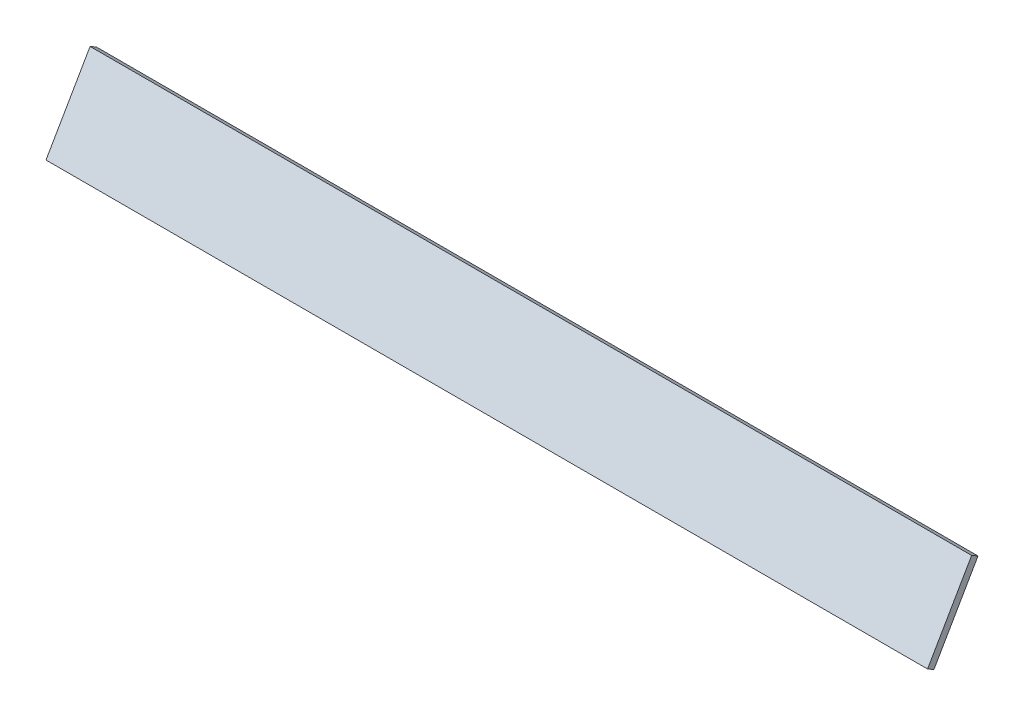
ISO-10303-21;
HEADER;
FILE_DESCRIPTION(('STEP AP214'),'2;1');
FILE_NAME('part.step','',(''),(''),'','','');
FILE_SCHEMA(('AUTOMOTIVE_DESIGN { 1 0 10303 214 1 1 1 1 }'));
ENDSEC;
DATA;
#1=APPLICATION_CONTEXT('core data for automotive mechanical design processes');
#2=APPLICATION_PROTOCOL_DEFINITION('international standard','automotive_design',2000,#1);
#3=PRODUCT_CONTEXT('',#1,'mechanical');
#4=PRODUCT('Part','Part','',(#3));
#5=PRODUCT_RELATED_PRODUCT_CATEGORY('part','',(#4));
#6=PRODUCT_DEFINITION_FORMATION('','',#4);
#7=PRODUCT_DEFINITION_CONTEXT('part definition',#1,'design');
#8=PRODUCT_DEFINITION('design','',#6,#7);
#9=PRODUCT_DEFINITION_SHAPE('','',#8);
#10=(LENGTH_UNIT() NAMED_UNIT(*) SI_UNIT(.MILLI.,.METRE.));
#11=(NAMED_UNIT(*) PLANE_ANGLE_UNIT() SI_UNIT($,.RADIAN.));
#12=(NAMED_UNIT(*) SI_UNIT($,.STERADIAN.) SOLID_ANGLE_UNIT());
#13=UNCERTAINTY_MEASURE_WITH_UNIT(LENGTH_MEASURE(1.E-05),#10,'distance_accuracy_value','');
#14=(GEOMETRIC_REPRESENTATION_CONTEXT(3) GLOBAL_UNCERTAINTY_ASSIGNED_CONTEXT((#13)) GLOBAL_UNIT_ASSIGNED_CONTEXT((#10,
#11,#12)) REPRESENTATION_CONTEXT('',''));
#15=CARTESIAN_POINT('',(0.,0.,0.));
#16=DIRECTION('',(0.,0.,1.));
#17=DIRECTION('',(1.,0.,0.));
#18=AXIS2_PLACEMENT_3D('',#15,#16,#17);
#19=CARTESIAN_POINT('',(364.378686242192,7.59807621135333,-66.5));
#20=DIRECTION('',(0.,-0.866025403784437,0.500000000000002));
#21=DIRECTION('',(0.,-0.500000000000002,-0.866025403784437));
#22=AXIS2_PLACEMENT_3D('',#19,#20,#21);
#23=PLANE('',#22);
#24=DIRECTION('',(0.,-0.500000000000002,-0.866025403784437));
#25=VECTOR('',#24,1.);
#26=CARTESIAN_POINT('',(300.,7.59807621135333,-66.5));
#27=LINE('',#26,#25);
#28=CARTESIAN_POINT('',(300.,10.0980762113531,-62.1698729810782));
#29=VERTEX_POINT('',#28);
#30=CARTESIAN_POINT('',(300.,7.59807621135333,-66.5));
#31=VERTEX_POINT('',#30);
#32=EDGE_CURVE('E40',#29,#31,#27,.T.);
#33=ORIENTED_EDGE('',*,*,#32,.F.);
#34=DIRECTION('',(-1.,0.,0.));
#35=VECTOR('',#34,1.);
#36=CARTESIAN_POINT('',(364.378686242192,10.0980762113531,-62.1698729810782));
#37=LINE('',#36,#35);
#38=CARTESIAN_POINT('',(-300.,10.0980762113531,-62.1698729810782));
#39=VERTEX_POINT('',#38);
#40=EDGE_CURVE('E66',#29,#39,#37,.T.);
#41=ORIENTED_EDGE('',*,*,#40,.T.);
#42=DIRECTION('',(0.,0.500000000000002,0.866025403784437));
#43=VECTOR('',#42,1.);
#44=CARTESIAN_POINT('',(-300.,7.59807621135333,-66.5));
#45=LINE('',#44,#43);
#46=CARTESIAN_POINT('',(-300.,7.59807621135333,-66.5));
#47=VERTEX_POINT('',#46);
#48=EDGE_CURVE('E70',#47,#39,#45,.T.);
#49=ORIENTED_EDGE('',*,*,#48,.F.);
#50=DIRECTION('',(-1.,0.,0.));
#51=VECTOR('',#50,1.);
#52=CARTESIAN_POINT('',(364.378686242192,7.59807621135333,-66.5));
#53=LINE('',#52,#51);
#54=EDGE_CURVE('E92',#31,#47,#53,.T.);
#55=ORIENTED_EDGE('',*,*,#54,.F.);
#56=EDGE_LOOP('',(#33,#41,#49,#55));
#57=FACE_BOUND('',#56,.T.);
#58=ADVANCED_FACE('F32',(#57),#23,.T.);
#59=CARTESIAN_POINT('',(364.378686242192,59.5596004384197,-96.4999999999999));
#60=DIRECTION('',(0.,-0.499999999999998,-0.86602540378444));
#61=DIRECTION('',(0.,0.86602540378444,-0.499999999999998));
#62=AXIS2_PLACEMENT_3D('',#59,#60,#61);
#63=PLANE('',#62);
#64=DIRECTION('',(0.,0.86602540378444,-0.499999999999998));
#65=VECTOR('',#64,1.);
#66=CARTESIAN_POINT('',(300.,59.5596004384197,-96.4999999999999));
#67=LINE('',#66,#65);
#68=CARTESIAN_POINT('',(300.,59.5596004384197,-96.4999999999999));
#69=VERTEX_POINT('',#68);
#70=EDGE_CURVE('E104',#31,#69,#67,.T.);
#71=ORIENTED_EDGE('',*,*,#70,.F.);
#72=ORIENTED_EDGE('',*,*,#54,.T.);
#73=DIRECTION('',(0.,-0.86602540378444,0.499999999999998));
#74=VECTOR('',#73,1.);
#75=CARTESIAN_POINT('',(-300.,59.5596004384197,-96.4999999999999));
#76=LINE('',#75,#74);
#77=CARTESIAN_POINT('',(-300.,59.5596004384197,-96.4999999999999));
#78=VERTEX_POINT('',#77);
#79=EDGE_CURVE('E74',#78,#47,#76,.T.);
#80=ORIENTED_EDGE('',*,*,#79,.F.);
#81=DIRECTION('',(-1.,0.,0.));
#82=VECTOR('',#81,1.);
#83=CARTESIAN_POINT('',(364.378686242192,59.5596004384197,-96.4999999999999));
#84=LINE('',#83,#82);
#85=EDGE_CURVE('E95',#69,#78,#84,.T.);
#86=ORIENTED_EDGE('',*,*,#85,.F.);
#87=EDGE_LOOP('',(#71,#72,#80,#86));
#88=FACE_BOUND('',#87,.T.);
#89=ADVANCED_FACE('F103',(#88),#63,.T.);
#90=CARTESIAN_POINT('',(364.378686242192,62.0596004384197,-92.1698729810777));
#91=DIRECTION('',(0.,0.866025403784441,-0.499999999999997));
#92=DIRECTION('',(0.,0.499999999999997,0.866025403784441));
#93=AXIS2_PLACEMENT_3D('',#90,#91,#92);
#94=PLANE('',#93);
#95=DIRECTION('',(0.,0.499999999999997,0.866025403784441));
#96=VECTOR('',#95,1.);
#97=CARTESIAN_POINT('',(300.,62.0596004384197,-92.1698729810777));
#98=LINE('',#97,#96);
#99=CARTESIAN_POINT('',(300.,62.0596004384197,-92.1698729810777));
#100=VERTEX_POINT('',#99);
#101=EDGE_CURVE('E94',#69,#100,#98,.T.);
#102=ORIENTED_EDGE('',*,*,#101,.F.);
#103=ORIENTED_EDGE('',*,*,#85,.T.);
#104=DIRECTION('',(0.,-0.499999999999997,-0.866025403784441));
#105=VECTOR('',#104,1.);
#106=CARTESIAN_POINT('',(-300.,62.0596004384197,-92.1698729810777));
#107=LINE('',#106,#105);
#108=CARTESIAN_POINT('',(-300.,62.0596004384197,-92.1698729810777));
#109=VERTEX_POINT('',#108);
#110=EDGE_CURVE('E82',#109,#78,#107,.T.);
#111=ORIENTED_EDGE('',*,*,#110,.F.);
#112=DIRECTION('',(-1.,0.,0.));
#113=VECTOR('',#112,1.);
#114=CARTESIAN_POINT('',(364.378686242192,62.0596004384197,-92.1698729810777));
#115=LINE('',#114,#113);
#116=EDGE_CURVE('E73',#100,#109,#115,.T.);
#117=ORIENTED_EDGE('',*,*,#116,.F.);
#118=EDGE_LOOP('',(#102,#103,#111,#117));
#119=FACE_BOUND('',#118,.T.);
#120=ADVANCED_FACE('F100',(#119),#94,.T.);
#121=CARTESIAN_POINT('',(364.378686242192,10.0980762113531,-62.1698729810782));
#122=DIRECTION('',(0.,0.499999999999991,0.866025403784444));
#123=DIRECTION('',(0.,-0.866025403784444,0.499999999999991));
#124=AXIS2_PLACEMENT_3D('',#121,#122,#123);
#125=PLANE('',#124);
#126=DIRECTION('',(0.,-0.866025403784444,0.499999999999991));
#127=VECTOR('',#126,1.);
#128=CARTESIAN_POINT('',(300.,10.0980762113531,-62.1698729810782));
#129=LINE('',#128,#127);
#130=EDGE_CURVE('E11',#100,#29,#129,.T.);
#131=ORIENTED_EDGE('',*,*,#130,.F.);
#132=ORIENTED_EDGE('',*,*,#116,.T.);
#133=DIRECTION('',(0.,0.866025403784444,-0.499999999999991));
#134=VECTOR('',#133,1.);
#135=CARTESIAN_POINT('',(-300.,10.0980762113531,-62.1698729810782));
#136=LINE('',#135,#134);
#137=EDGE_CURVE('E76',#39,#109,#136,.T.);
#138=ORIENTED_EDGE('',*,*,#137,.F.);
#139=ORIENTED_EDGE('',*,*,#40,.F.);
#140=EDGE_LOOP('',(#131,#132,#138,#139));
#141=FACE_BOUND('',#140,.T.);
#142=ADVANCED_FACE('F77',(#141),#125,.T.);
#143=CARTESIAN_POINT('',(-300.,0.,0.));
#144=DIRECTION('',(-1.,0.,0.));
#145=DIRECTION('',(0.,0.,1.));
#146=AXIS2_PLACEMENT_3D('',#143,#144,#145);
#147=PLANE('',#146);
#148=ORIENTED_EDGE('',*,*,#48,.T.);
#149=ORIENTED_EDGE('',*,*,#137,.T.);
#150=ORIENTED_EDGE('',*,*,#110,.T.);
#151=ORIENTED_EDGE('',*,*,#79,.T.);
#152=EDGE_LOOP('',(#148,#149,#150,#151));
#153=FACE_BOUND('',#152,.T.);
#154=ADVANCED_FACE('F84',(#153),#147,.T.);
#155=CARTESIAN_POINT('',(300.,5.,-135.));
#156=DIRECTION('',(-1.,0.,0.));
#157=DIRECTION('',(0.,0.,1.));
#158=AXIS2_PLACEMENT_3D('',#155,#156,#157);
#159=PLANE('',#158);
#160=ORIENTED_EDGE('',*,*,#32,.T.);
#161=ORIENTED_EDGE('',*,*,#70,.T.);
#162=ORIENTED_EDGE('',*,*,#101,.T.);
#163=ORIENTED_EDGE('',*,*,#130,.T.);
#164=EDGE_LOOP('',(#160,#161,#162,#163));
#165=FACE_BOUND('',#164,.T.);
#166=ADVANCED_FACE('F105',(#165),#159,.F.);
#167=CLOSED_SHELL('',(#58,#89,#120,#142,#154,#166));
#168=MANIFOLD_SOLID_BREP('B2',#167);
#169=ADVANCED_BREP_SHAPE_REPRESENTATION('',(#18,#168),#14);
#170=SHAPE_DEFINITION_REPRESENTATION(#9,#169);
ENDSEC;
END-ISO-10303-21;
